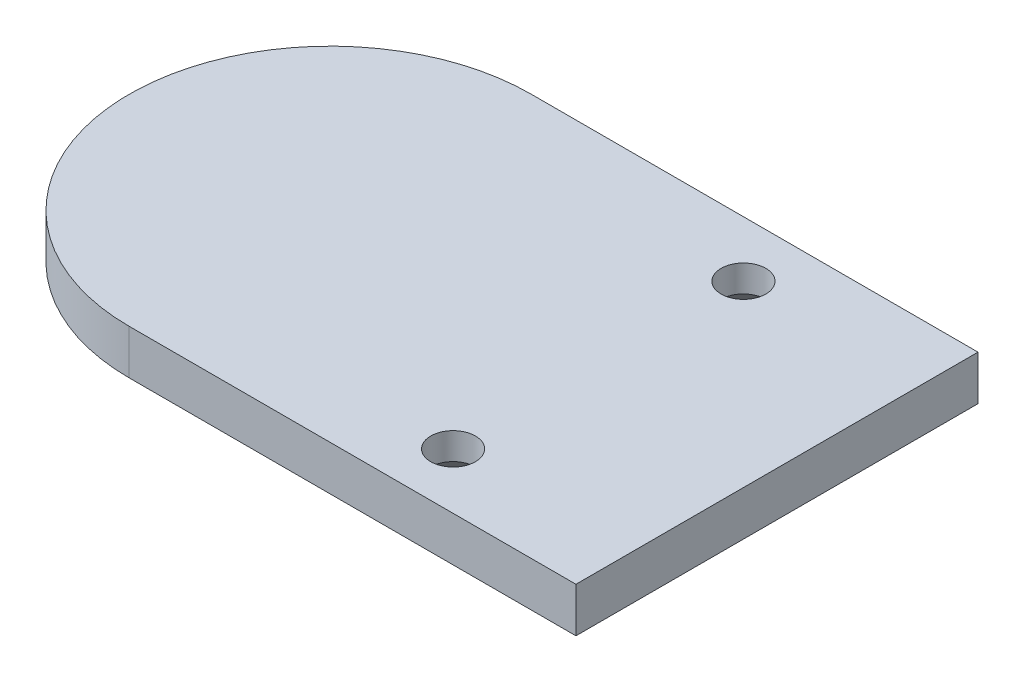
ISO-10303-21;
HEADER;
FILE_DESCRIPTION(('STEP AP214'),'2;1');
FILE_NAME('part.step','',(''),(''),'','','');
FILE_SCHEMA(('AUTOMOTIVE_DESIGN { 1 0 10303 214 1 1 1 1 }'));
ENDSEC;
DATA;
#1=APPLICATION_CONTEXT('core data for automotive mechanical design processes');
#2=APPLICATION_PROTOCOL_DEFINITION('international standard','automotive_design',2000,#1);
#3=PRODUCT_CONTEXT('',#1,'mechanical');
#4=PRODUCT('Part','Part','',(#3));
#5=PRODUCT_RELATED_PRODUCT_CATEGORY('part','',(#4));
#6=PRODUCT_DEFINITION_FORMATION('','',#4);
#7=PRODUCT_DEFINITION_CONTEXT('part definition',#1,'design');
#8=PRODUCT_DEFINITION('design','',#6,#7);
#9=PRODUCT_DEFINITION_SHAPE('','',#8);
#10=(LENGTH_UNIT() NAMED_UNIT(*) SI_UNIT(.MILLI.,.METRE.));
#11=(NAMED_UNIT(*) PLANE_ANGLE_UNIT() SI_UNIT($,.RADIAN.));
#12=(NAMED_UNIT(*) SI_UNIT($,.STERADIAN.) SOLID_ANGLE_UNIT());
#13=UNCERTAINTY_MEASURE_WITH_UNIT(LENGTH_MEASURE(1.E-05),#10,'distance_accuracy_value','');
#14=(GEOMETRIC_REPRESENTATION_CONTEXT(3) GLOBAL_UNCERTAINTY_ASSIGNED_CONTEXT((#13)) GLOBAL_UNIT_ASSIGNED_CONTEXT((#10,
#11,#12)) REPRESENTATION_CONTEXT('',''));
#15=CARTESIAN_POINT('',(0.,0.,0.));
#16=DIRECTION('',(0.,0.,1.));
#17=DIRECTION('',(1.,0.,0.));
#18=AXIS2_PLACEMENT_3D('',#15,#16,#17);
#19=CARTESIAN_POINT('',(0.,5.,0.));
#20=DIRECTION('',(0.,-1.,0.));
#21=DIRECTION('',(0.,0.,-1.));
#22=AXIS2_PLACEMENT_3D('',#19,#20,#21);
#23=CYLINDRICAL_SURFACE('',#22,22.5);
#24=CARTESIAN_POINT('',(0.,0.,0.));
#25=DIRECTION('',(0.,1.,0.));
#26=DIRECTION('',(0.,0.,1.));
#27=AXIS2_PLACEMENT_3D('',#24,#25,#26);
#28=CIRCLE('',#27,22.5);
#29=CARTESIAN_POINT('',(0.,0.,-22.5));
#30=VERTEX_POINT('',#29);
#31=CARTESIAN_POINT('',(0.,0.,22.5));
#32=VERTEX_POINT('',#31);
#33=EDGE_CURVE('E103',#30,#32,#28,.T.);
#34=ORIENTED_EDGE('',*,*,#33,.T.);
#35=DIRECTION('',(0.,-1.,0.));
#36=VECTOR('',#35,1.);
#37=CARTESIAN_POINT('',(0.,5.,22.5));
#38=LINE('',#37,#36);
#39=CARTESIAN_POINT('',(0.,5.,22.5));
#40=VERTEX_POINT('',#39);
#41=EDGE_CURVE('E94',#40,#32,#38,.T.);
#42=ORIENTED_EDGE('',*,*,#41,.F.);
#43=CARTESIAN_POINT('',(0.,5.,0.));
#44=DIRECTION('',(0.,1.,0.));
#45=DIRECTION('',(0.,0.,1.));
#46=AXIS2_PLACEMENT_3D('',#43,#44,#45);
#47=CIRCLE('',#46,22.5);
#48=CARTESIAN_POINT('',(0.,5.,-22.5));
#49=VERTEX_POINT('',#48);
#50=EDGE_CURVE('E88',#49,#40,#47,.T.);
#51=ORIENTED_EDGE('',*,*,#50,.F.);
#52=DIRECTION('',(0.,-1.,0.));
#53=VECTOR('',#52,1.);
#54=CARTESIAN_POINT('',(0.,5.,-22.5));
#55=LINE('',#54,#53);
#56=EDGE_CURVE('E99',#49,#30,#55,.T.);
#57=ORIENTED_EDGE('',*,*,#56,.T.);
#58=EDGE_LOOP('',(#34,#42,#51,#57));
#59=FACE_BOUND('',#58,.T.);
#60=ADVANCED_FACE('F34',(#59),#23,.T.);
#61=CARTESIAN_POINT('',(50.,5.,22.5));
#62=DIRECTION('',(0.,0.,-1.));
#63=DIRECTION('',(-1.,0.,0.));
#64=AXIS2_PLACEMENT_3D('',#61,#62,#63);
#65=PLANE('',#64);
#66=DIRECTION('',(1.,0.,0.));
#67=VECTOR('',#66,1.);
#68=CARTESIAN_POINT('',(50.,0.,22.5));
#69=LINE('',#68,#67);
#70=CARTESIAN_POINT('',(50.,0.,22.5));
#71=VERTEX_POINT('',#70);
#72=EDGE_CURVE('E93',#32,#71,#69,.T.);
#73=ORIENTED_EDGE('',*,*,#72,.T.);
#74=DIRECTION('',(0.,-1.,0.));
#75=VECTOR('',#74,1.);
#76=CARTESIAN_POINT('',(50.,5.,22.5));
#77=LINE('',#76,#75);
#78=CARTESIAN_POINT('',(50.,5.,22.5));
#79=VERTEX_POINT('',#78);
#80=EDGE_CURVE('E91',#79,#71,#77,.T.);
#81=ORIENTED_EDGE('',*,*,#80,.F.);
#82=DIRECTION('',(1.,0.,0.));
#83=VECTOR('',#82,1.);
#84=CARTESIAN_POINT('',(50.,5.,22.5));
#85=LINE('',#84,#83);
#86=EDGE_CURVE('E83',#40,#79,#85,.T.);
#87=ORIENTED_EDGE('',*,*,#86,.F.);
#88=ORIENTED_EDGE('',*,*,#41,.T.);
#89=EDGE_LOOP('',(#73,#81,#87,#88));
#90=FACE_BOUND('',#89,.T.);
#91=ADVANCED_FACE('F92',(#90),#65,.F.);
#92=CARTESIAN_POINT('',(50.,5.,-22.5));
#93=DIRECTION('',(-1.,0.,0.));
#94=DIRECTION('',(0.,0.,1.));
#95=AXIS2_PLACEMENT_3D('',#92,#93,#94);
#96=PLANE('',#95);
#97=DIRECTION('',(0.,0.,-1.));
#98=VECTOR('',#97,1.);
#99=CARTESIAN_POINT('',(50.,0.,-22.5));
#100=LINE('',#99,#98);
#101=CARTESIAN_POINT('',(50.,0.,-22.5));
#102=VERTEX_POINT('',#101);
#103=EDGE_CURVE('E69',#71,#102,#100,.T.);
#104=ORIENTED_EDGE('',*,*,#103,.T.);
#105=DIRECTION('',(0.,-1.,0.));
#106=VECTOR('',#105,1.);
#107=CARTESIAN_POINT('',(50.,5.,-22.5));
#108=LINE('',#107,#106);
#109=CARTESIAN_POINT('',(50.,5.,-22.5));
#110=VERTEX_POINT('',#109);
#111=EDGE_CURVE('E95',#110,#102,#108,.T.);
#112=ORIENTED_EDGE('',*,*,#111,.F.);
#113=DIRECTION('',(0.,0.,-1.));
#114=VECTOR('',#113,1.);
#115=CARTESIAN_POINT('',(50.,5.,-22.5));
#116=LINE('',#115,#114);
#117=EDGE_CURVE('E86',#79,#110,#116,.T.);
#118=ORIENTED_EDGE('',*,*,#117,.F.);
#119=ORIENTED_EDGE('',*,*,#80,.T.);
#120=EDGE_LOOP('',(#104,#112,#118,#119));
#121=FACE_BOUND('',#120,.T.);
#122=ADVANCED_FACE('F97',(#121),#96,.F.);
#123=CARTESIAN_POINT('',(0.,5.,-22.5));
#124=DIRECTION('',(0.,0.,1.));
#125=DIRECTION('',(1.,0.,0.));
#126=AXIS2_PLACEMENT_3D('',#123,#124,#125);
#127=PLANE('',#126);
#128=DIRECTION('',(-1.,0.,0.));
#129=VECTOR('',#128,1.);
#130=CARTESIAN_POINT('',(0.,0.,-22.5));
#131=LINE('',#130,#129);
#132=EDGE_CURVE('E75',#102,#30,#131,.T.);
#133=ORIENTED_EDGE('',*,*,#132,.T.);
#134=ORIENTED_EDGE('',*,*,#56,.F.);
#135=DIRECTION('',(-1.,0.,0.));
#136=VECTOR('',#135,1.);
#137=CARTESIAN_POINT('',(0.,5.,-22.5));
#138=LINE('',#137,#136);
#139=EDGE_CURVE('E52',#110,#49,#138,.T.);
#140=ORIENTED_EDGE('',*,*,#139,.F.);
#141=ORIENTED_EDGE('',*,*,#111,.T.);
#142=EDGE_LOOP('',(#133,#134,#140,#141));
#143=FACE_BOUND('',#142,.T.);
#144=ADVANCED_FACE('F145',(#143),#127,.F.);
#145=CARTESIAN_POINT('',(0.,5.,0.));
#146=DIRECTION('',(0.,1.,0.));
#147=DIRECTION('',(0.,0.,1.));
#148=AXIS2_PLACEMENT_3D('',#145,#146,#147);
#149=PLANE('',#148);
#150=CARTESIAN_POINT('',(30.,5.,-16.25));
#151=DIRECTION('',(0.,1.,0.));
#152=DIRECTION('',(0.,0.,1.));
#153=AXIS2_PLACEMENT_3D('',#150,#151,#152);
#154=CIRCLE('',#153,2.49999999999999);
#155=CARTESIAN_POINT('',(30.,5.,-13.75));
#156=VERTEX_POINT('',#155);
#157=EDGE_CURVE('E106',#156,#156,#154,.T.);
#158=ORIENTED_EDGE('',*,*,#157,.F.);
#159=EDGE_LOOP('',(#158));
#160=FACE_BOUND('',#159,.T.);
#161=CARTESIAN_POINT('',(30.,5.,16.25));
#162=DIRECTION('',(0.,1.,0.));
#163=DIRECTION('',(0.,0.,-1.));
#164=AXIS2_PLACEMENT_3D('',#161,#162,#163);
#165=CIRCLE('',#164,2.49999999999999);
#166=CARTESIAN_POINT('',(30.,5.,13.75));
#167=VERTEX_POINT('',#166);
#168=EDGE_CURVE('E137',#167,#167,#165,.T.);
#169=ORIENTED_EDGE('',*,*,#168,.F.);
#170=EDGE_LOOP('',(#169));
#171=FACE_BOUND('',#170,.T.);
#172=ORIENTED_EDGE('',*,*,#50,.T.);
#173=ORIENTED_EDGE('',*,*,#86,.T.);
#174=ORIENTED_EDGE('',*,*,#117,.T.);
#175=ORIENTED_EDGE('',*,*,#139,.T.);
#176=EDGE_LOOP('',(#172,#173,#174,#175));
#177=FACE_BOUND('',#176,.T.);
#178=ADVANCED_FACE('F84',(#160,#171,#177),#149,.T.);
#179=CARTESIAN_POINT('',(0.,0.,0.));
#180=DIRECTION('',(0.,1.,0.));
#181=DIRECTION('',(0.,0.,1.));
#182=AXIS2_PLACEMENT_3D('',#179,#180,#181);
#183=PLANE('',#182);
#184=CARTESIAN_POINT('',(30.,0.,-16.25));
#185=DIRECTION('',(0.,1.,0.));
#186=DIRECTION('',(0.,0.,1.));
#187=AXIS2_PLACEMENT_3D('',#184,#185,#186);
#188=CIRCLE('',#187,4.5);
#189=CARTESIAN_POINT('',(30.,0.,-11.75));
#190=VERTEX_POINT('',#189);
#191=EDGE_CURVE('E44',#190,#190,#188,.T.);
#192=ORIENTED_EDGE('',*,*,#191,.T.);
#193=EDGE_LOOP('',(#192));
#194=FACE_BOUND('',#193,.T.);
#195=CARTESIAN_POINT('',(30.,0.,16.25));
#196=DIRECTION('',(0.,1.,0.));
#197=DIRECTION('',(0.,0.,1.));
#198=AXIS2_PLACEMENT_3D('',#195,#196,#197);
#199=CIRCLE('',#198,4.5);
#200=CARTESIAN_POINT('',(30.,0.,20.75));
#201=VERTEX_POINT('',#200);
#202=EDGE_CURVE('E116',#201,#201,#199,.T.);
#203=ORIENTED_EDGE('',*,*,#202,.T.);
#204=EDGE_LOOP('',(#203));
#205=FACE_BOUND('',#204,.T.);
#206=ORIENTED_EDGE('',*,*,#33,.F.);
#207=ORIENTED_EDGE('',*,*,#132,.F.);
#208=ORIENTED_EDGE('',*,*,#103,.F.);
#209=ORIENTED_EDGE('',*,*,#72,.F.);
#210=EDGE_LOOP('',(#206,#207,#208,#209));
#211=FACE_BOUND('',#210,.T.);
#212=ADVANCED_FACE('F121',(#194,#205,#211),#183,.F.);
#213=CARTESIAN_POINT('',(30.,5.,16.25));
#214=DIRECTION('',(0.,-1.,0.));
#215=DIRECTION('',(0.,0.,-1.));
#216=AXIS2_PLACEMENT_3D('',#213,#214,#215);
#217=CYLINDRICAL_SURFACE('',#216,2.49999999999999);
#218=CARTESIAN_POINT('',(30.,2.,16.25));
#219=DIRECTION('',(0.,1.,0.));
#220=DIRECTION('',(0.,0.,1.));
#221=AXIS2_PLACEMENT_3D('',#218,#219,#220);
#222=CIRCLE('',#221,2.49999999999999);
#223=CARTESIAN_POINT('',(30.,2.,18.75));
#224=VERTEX_POINT('',#223);
#225=EDGE_CURVE('E11',#224,#224,#222,.F.);
#226=ORIENTED_EDGE('',*,*,#225,.T.);
#227=EDGE_LOOP('',(#226));
#228=FACE_BOUND('',#227,.T.);
#229=ORIENTED_EDGE('',*,*,#168,.T.);
#230=EDGE_LOOP('',(#229));
#231=FACE_BOUND('',#230,.T.);
#232=ADVANCED_FACE('F132',(#228,#231),#217,.F.);
#233=CARTESIAN_POINT('',(30.,5.,-16.25));
#234=DIRECTION('',(0.,-1.,0.));
#235=DIRECTION('',(0.,0.,-1.));
#236=AXIS2_PLACEMENT_3D('',#233,#234,#235);
#237=CYLINDRICAL_SURFACE('',#236,2.49999999999999);
#238=CARTESIAN_POINT('',(30.,2.,-16.25));
#239=DIRECTION('',(0.,1.,0.));
#240=DIRECTION('',(0.,0.,1.));
#241=AXIS2_PLACEMENT_3D('',#238,#239,#240);
#242=CIRCLE('',#241,2.49999999999999);
#243=CARTESIAN_POINT('',(30.,2.,-13.75));
#244=VERTEX_POINT('',#243);
#245=EDGE_CURVE('E113',#244,#244,#242,.F.);
#246=ORIENTED_EDGE('',*,*,#245,.T.);
#247=EDGE_LOOP('',(#246));
#248=FACE_BOUND('',#247,.T.);
#249=ORIENTED_EDGE('',*,*,#157,.T.);
#250=EDGE_LOOP('',(#249));
#251=FACE_BOUND('',#250,.T.);
#252=ADVANCED_FACE('F127',(#248,#251),#237,.F.);
#253=CARTESIAN_POINT('',(30.,2.,-16.25));
#254=DIRECTION('',(0.,-1.,0.));
#255=DIRECTION('',(0.,0.,-1.));
#256=AXIS2_PLACEMENT_3D('',#253,#254,#255);
#257=CONICAL_SURFACE('',#256,2.49999999999999,0.785398163397451);
#258=ORIENTED_EDGE('',*,*,#191,.F.);
#259=EDGE_LOOP('',(#258));
#260=FACE_BOUND('',#259,.T.);
#261=ORIENTED_EDGE('',*,*,#245,.F.);
#262=EDGE_LOOP('',(#261));
#263=FACE_BOUND('',#262,.T.);
#264=ADVANCED_FACE('F124',(#260,#263),#257,.F.);
#265=CARTESIAN_POINT('',(30.,2.,16.25));
#266=DIRECTION('',(0.,-1.,0.));
#267=DIRECTION('',(0.,0.,-1.));
#268=AXIS2_PLACEMENT_3D('',#265,#266,#267);
#269=CONICAL_SURFACE('',#268,2.49999999999999,0.785398163397451);
#270=ORIENTED_EDGE('',*,*,#202,.F.);
#271=EDGE_LOOP('',(#270));
#272=FACE_BOUND('',#271,.T.);
#273=ORIENTED_EDGE('',*,*,#225,.F.);
#274=EDGE_LOOP('',(#273));
#275=FACE_BOUND('',#274,.T.);
#276=ADVANCED_FACE('F37',(#272,#275),#269,.F.);
#277=CLOSED_SHELL('',(#60,#91,#122,#144,#178,#212,#232,#252,#264,#276));
#278=MANIFOLD_SOLID_BREP('B2',#277);
#279=ADVANCED_BREP_SHAPE_REPRESENTATION('',(#18,#278),#14);
#280=SHAPE_DEFINITION_REPRESENTATION(#9,#279);
ENDSEC;
END-ISO-10303-21;
